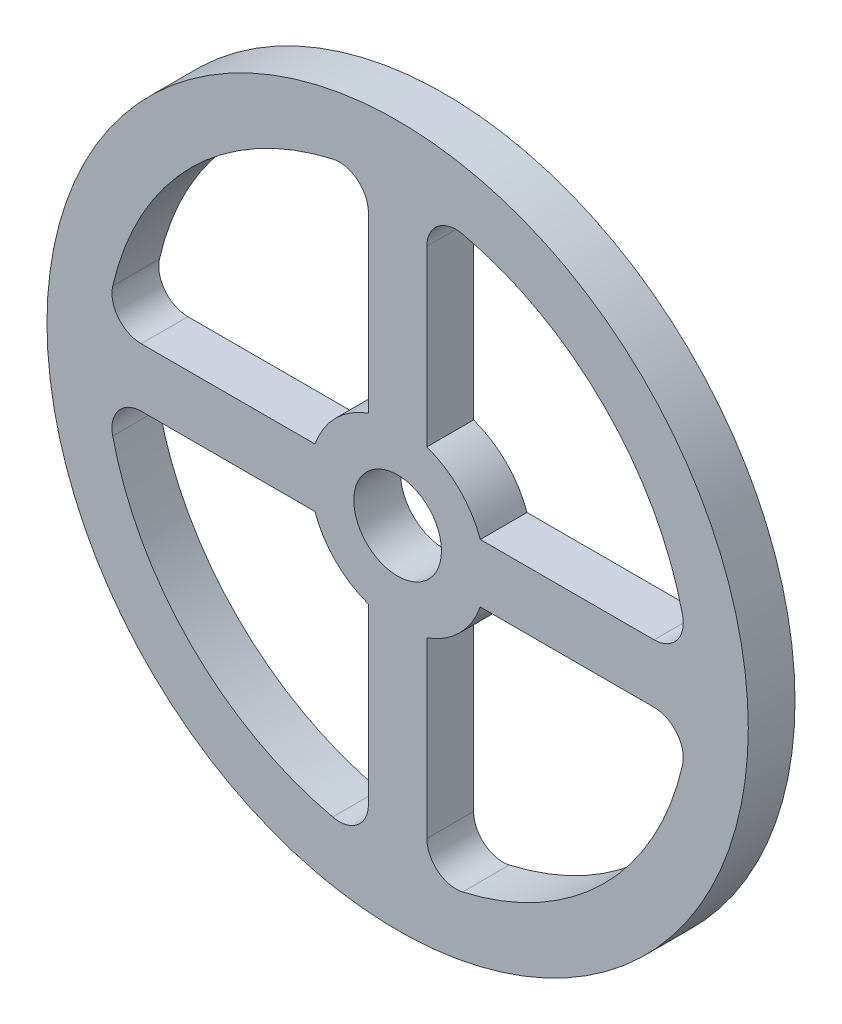
ISO-10303-21;
HEADER;
FILE_DESCRIPTION(('STEP AP214'),'2;1');
FILE_NAME('part.step','',(''),(''),'','','');
FILE_SCHEMA(('AUTOMOTIVE_DESIGN { 1 0 10303 214 1 1 1 1 }'));
ENDSEC;
DATA;
#1=APPLICATION_CONTEXT('core data for automotive mechanical design processes');
#2=APPLICATION_PROTOCOL_DEFINITION('international standard','automotive_design',2000,#1);
#3=PRODUCT_CONTEXT('',#1,'mechanical');
#4=PRODUCT('Part','Part','',(#3));
#5=PRODUCT_RELATED_PRODUCT_CATEGORY('part','',(#4));
#6=PRODUCT_DEFINITION_FORMATION('','',#4);
#7=PRODUCT_DEFINITION_CONTEXT('part definition',#1,'design');
#8=PRODUCT_DEFINITION('design','',#6,#7);
#9=PRODUCT_DEFINITION_SHAPE('','',#8);
#10=(LENGTH_UNIT() NAMED_UNIT(*) SI_UNIT(.MILLI.,.METRE.));
#11=(NAMED_UNIT(*) PLANE_ANGLE_UNIT() SI_UNIT($,.RADIAN.));
#12=(NAMED_UNIT(*) SI_UNIT($,.STERADIAN.) SOLID_ANGLE_UNIT());
#13=UNCERTAINTY_MEASURE_WITH_UNIT(LENGTH_MEASURE(1.E-05),#10,'distance_accuracy_value','');
#14=(GEOMETRIC_REPRESENTATION_CONTEXT(3) GLOBAL_UNCERTAINTY_ASSIGNED_CONTEXT((#13)) GLOBAL_UNIT_ASSIGNED_CONTEXT((#10,
#11,#12)) REPRESENTATION_CONTEXT('',''));
#15=CARTESIAN_POINT('',(0.,0.,0.));
#16=DIRECTION('',(0.,0.,1.));
#17=DIRECTION('',(1.,0.,0.));
#18=AXIS2_PLACEMENT_3D('',#15,#16,#17);
#19=CARTESIAN_POINT('',(-157.313413120744,131.737380840465,16.));
#20=DIRECTION('',(0.,0.,1.));
#21=DIRECTION('',(1.,0.,0.));
#22=AXIS2_PLACEMENT_3D('',#19,#20,#21);
#23=PLANE('',#22);
#24=DIRECTION('',(1.,0.,0.));
#25=VECTOR('',#24,1.);
#26=CARTESIAN_POINT('',(-245.063056994665,141.737380840465,16.));
#27=LINE('',#26,#25);
#28=CARTESIAN_POINT('',(-245.063056994665,141.737380840465,16.));
#29=VERTEX_POINT('',#28);
#30=CARTESIAN_POINT('',(-185.597684368206,141.737380840465,16.));
#31=VERTEX_POINT('',#30);
#32=EDGE_CURVE('E411',#29,#31,#27,.T.);
#33=ORIENTED_EDGE('',*,*,#32,.F.);
#34=CARTESIAN_POINT('',(-245.063056994665,151.737380840465,16.));
#35=DIRECTION('',(0.,0.,1.));
#36=DIRECTION('',(-1.,0.,0.));
#37=AXIS2_PLACEMENT_3D('',#34,#35,#36);
#38=CIRCLE('',#37,10.);
#39=CARTESIAN_POINT('',(-254.813017425101,153.959603062687,16.));
#40=VERTEX_POINT('',#39);
#41=EDGE_CURVE('E408',#40,#29,#38,.T.);
#42=ORIENTED_EDGE('',*,*,#41,.F.);
#43=CARTESIAN_POINT('',(-157.313413120744,131.737380840465,16.));
#44=DIRECTION('',(0.,0.,1.));
#45=DIRECTION('',(1.,0.,0.));
#46=AXIS2_PLACEMENT_3D('',#43,#44,#45);
#47=CIRCLE('',#46,100.);
#48=CARTESIAN_POINT('',(-179.535635342966,229.236985144822,16.));
#49=VERTEX_POINT('',#48);
#50=EDGE_CURVE('E425',#49,#40,#47,.T.);
#51=ORIENTED_EDGE('',*,*,#50,.F.);
#52=CARTESIAN_POINT('',(-177.313413120744,219.487024714386,16.));
#53=DIRECTION('',(0.,0.,1.));
#54=DIRECTION('',(1.,0.,0.));
#55=AXIS2_PLACEMENT_3D('',#52,#53,#54);
#56=CIRCLE('',#55,9.99999999999999);
#57=CARTESIAN_POINT('',(-167.313413120744,219.487024714386,16.));
#58=VERTEX_POINT('',#57);
#59=EDGE_CURVE('E421',#58,#49,#56,.T.);
#60=ORIENTED_EDGE('',*,*,#59,.F.);
#61=DIRECTION('',(0.,1.,0.));
#62=VECTOR('',#61,1.);
#63=CARTESIAN_POINT('',(-167.313413120744,219.487024714386,16.));
#64=LINE('',#63,#62);
#65=CARTESIAN_POINT('',(-167.313413120744,160.021652087927,16.));
#66=VERTEX_POINT('',#65);
#67=EDGE_CURVE('E418',#66,#58,#64,.T.);
#68=ORIENTED_EDGE('',*,*,#67,.F.);
#69=CARTESIAN_POINT('',(-157.313413120744,131.737380840465,16.));
#70=DIRECTION('',(0.,0.,-1.));
#71=DIRECTION('',(1.,0.,0.));
#72=AXIS2_PLACEMENT_3D('',#69,#70,#71);
#73=CIRCLE('',#72,30.);
#74=EDGE_CURVE('E415',#31,#66,#73,.T.);
#75=ORIENTED_EDGE('',*,*,#74,.F.);
#76=EDGE_LOOP('',(#33,#42,#51,#60,#68,#75));
#77=FACE_BOUND('',#76,.T.);
#78=CARTESIAN_POINT('',(-157.313413120744,131.737380840465,16.));
#79=DIRECTION('',(0.,0.,1.));
#80=DIRECTION('',(1.,0.,0.));
#81=AXIS2_PLACEMENT_3D('',#78,#79,#80);
#82=CIRCLE('',#81,120.);
#83=CARTESIAN_POINT('',(-37.3134131207438,131.737380840465,16.));
#84=VERTEX_POINT('',#83);
#85=EDGE_CURVE('E11',#84,#84,#82,.T.);
#86=ORIENTED_EDGE('',*,*,#85,.T.);
#87=EDGE_LOOP('',(#86));
#88=FACE_BOUND('',#87,.T.);
#89=CARTESIAN_POINT('',(-157.313413120744,131.737380840465,16.));
#90=DIRECTION('',(0.,0.,1.));
#91=DIRECTION('',(1.,0.,0.));
#92=AXIS2_PLACEMENT_3D('',#89,#90,#91);
#93=CIRCLE('',#92,15.);
#94=CARTESIAN_POINT('',(-142.313413120744,131.737380840465,16.));
#95=VERTEX_POINT('',#94);
#96=EDGE_CURVE('E400',#95,#95,#93,.T.);
#97=ORIENTED_EDGE('',*,*,#96,.F.);
#98=EDGE_LOOP('',(#97));
#99=FACE_BOUND('',#98,.T.);
#100=DIRECTION('',(-1.,0.,0.));
#101=VECTOR('',#100,1.);
#102=CARTESIAN_POINT('',(-245.063056994665,121.737380840465,16.));
#103=LINE('',#102,#101);
#104=CARTESIAN_POINT('',(-185.597684368206,121.737380840465,16.));
#105=VERTEX_POINT('',#104);
#106=CARTESIAN_POINT('',(-245.063056994665,121.737380840465,16.));
#107=VERTEX_POINT('',#106);
#108=EDGE_CURVE('E340',#105,#107,#103,.T.);
#109=ORIENTED_EDGE('',*,*,#108,.F.);
#110=CARTESIAN_POINT('',(-157.313413120744,131.737380840465,16.));
#111=DIRECTION('',(0.,0.,-1.));
#112=DIRECTION('',(1.,0.,0.));
#113=AXIS2_PLACEMENT_3D('',#110,#111,#112);
#114=CIRCLE('',#113,30.);
#115=CARTESIAN_POINT('',(-167.313413120744,103.453109593003,16.));
#116=VERTEX_POINT('',#115);
#117=EDGE_CURVE('E337',#116,#105,#114,.T.);
#118=ORIENTED_EDGE('',*,*,#117,.F.);
#119=DIRECTION('',(0.,1.,0.));
#120=VECTOR('',#119,1.);
#121=CARTESIAN_POINT('',(-167.313413120744,103.453109593003,16.));
#122=LINE('',#121,#120);
#123=CARTESIAN_POINT('',(-167.313413120744,43.9877369665436,16.));
#124=VERTEX_POINT('',#123);
#125=EDGE_CURVE('E354',#124,#116,#122,.T.);
#126=ORIENTED_EDGE('',*,*,#125,.F.);
#127=CARTESIAN_POINT('',(-177.313413120744,43.9877369665436,16.));
#128=DIRECTION('',(0.,0.,1.));
#129=DIRECTION('',(1.,0.,0.));
#130=AXIS2_PLACEMENT_3D('',#127,#128,#129);
#131=CIRCLE('',#130,10.);
#132=CARTESIAN_POINT('',(-179.535635342966,34.2377765361079,16.));
#133=VERTEX_POINT('',#132);
#134=EDGE_CURVE('E350',#133,#124,#131,.T.);
#135=ORIENTED_EDGE('',*,*,#134,.F.);
#136=CARTESIAN_POINT('',(-157.313413120744,131.737380840465,16.));
#137=DIRECTION('',(0.,0.,1.));
#138=DIRECTION('',(1.,0.,0.));
#139=AXIS2_PLACEMENT_3D('',#136,#137,#138);
#140=CIRCLE('',#139,100.);
#141=CARTESIAN_POINT('',(-254.813017425101,109.515158618243,16.));
#142=VERTEX_POINT('',#141);
#143=EDGE_CURVE('E347',#142,#133,#140,.T.);
#144=ORIENTED_EDGE('',*,*,#143,.F.);
#145=CARTESIAN_POINT('',(-245.063056994665,111.737380840465,16.));
#146=DIRECTION('',(0.,0.,1.));
#147=DIRECTION('',(1.,0.,0.));
#148=AXIS2_PLACEMENT_3D('',#145,#146,#147);
#149=CIRCLE('',#148,10.);
#150=EDGE_CURVE('E344',#107,#142,#149,.T.);
#151=ORIENTED_EDGE('',*,*,#150,.F.);
#152=EDGE_LOOP('',(#109,#118,#126,#135,#144,#151));
#153=FACE_BOUND('',#152,.T.);
#154=DIRECTION('',(0.,-1.,0.));
#155=VECTOR('',#154,1.);
#156=CARTESIAN_POINT('',(-147.313413120744,103.453109593003,16.));
#157=LINE('',#156,#155);
#158=CARTESIAN_POINT('',(-147.313413120744,103.453109593003,16.));
#159=VERTEX_POINT('',#158);
#160=CARTESIAN_POINT('',(-147.313413120744,43.9877369665436,16.));
#161=VERTEX_POINT('',#160);
#162=EDGE_CURVE('E277',#159,#161,#157,.T.);
#163=ORIENTED_EDGE('',*,*,#162,.F.);
#164=CARTESIAN_POINT('',(-157.313413120744,131.737380840465,16.));
#165=DIRECTION('',(0.,0.,-1.));
#166=DIRECTION('',(1.,0.,0.));
#167=AXIS2_PLACEMENT_3D('',#164,#165,#166);
#168=CIRCLE('',#167,30.);
#169=CARTESIAN_POINT('',(-129.029141873282,121.737380840465,16.));
#170=VERTEX_POINT('',#169);
#171=EDGE_CURVE('E274',#170,#159,#168,.T.);
#172=ORIENTED_EDGE('',*,*,#171,.F.);
#173=DIRECTION('',(-1.,0.,0.));
#174=VECTOR('',#173,1.);
#175=CARTESIAN_POINT('',(-129.029141873282,121.737380840465,16.));
#176=LINE('',#175,#174);
#177=CARTESIAN_POINT('',(-69.5637692468226,121.737380840465,16.));
#178=VERTEX_POINT('',#177);
#179=EDGE_CURVE('E291',#178,#170,#176,.T.);
#180=ORIENTED_EDGE('',*,*,#179,.F.);
#181=CARTESIAN_POINT('',(-69.5637692468226,111.737380840465,16.));
#182=DIRECTION('',(0.,0.,1.));
#183=DIRECTION('',(1.,0.,0.));
#184=AXIS2_PLACEMENT_3D('',#181,#182,#183);
#185=CIRCLE('',#184,9.99999999999999);
#186=CARTESIAN_POINT('',(-59.8138088163869,109.515158618243,16.));
#187=VERTEX_POINT('',#186);
#188=EDGE_CURVE('E287',#187,#178,#185,.T.);
#189=ORIENTED_EDGE('',*,*,#188,.F.);
#190=CARTESIAN_POINT('',(-157.313413120744,131.737380840465,16.));
#191=DIRECTION('',(0.,0.,1.));
#192=DIRECTION('',(1.,0.,0.));
#193=AXIS2_PLACEMENT_3D('',#190,#191,#192);
#194=CIRCLE('',#193,100.);
#195=CARTESIAN_POINT('',(-135.091190898522,34.2377765361079,16.));
#196=VERTEX_POINT('',#195);
#197=EDGE_CURVE('E284',#196,#187,#194,.T.);
#198=ORIENTED_EDGE('',*,*,#197,.F.);
#199=CARTESIAN_POINT('',(-137.313413120744,43.9877369665436,16.));
#200=DIRECTION('',(0.,0.,1.));
#201=DIRECTION('',(-1.,0.,0.));
#202=AXIS2_PLACEMENT_3D('',#199,#200,#201);
#203=CIRCLE('',#202,9.99999999999999);
#204=EDGE_CURVE('E281',#161,#196,#203,.T.);
#205=ORIENTED_EDGE('',*,*,#204,.F.);
#206=EDGE_LOOP('',(#163,#172,#180,#189,#198,#205));
#207=FACE_BOUND('',#206,.T.);
#208=DIRECTION('',(1.,0.,0.));
#209=VECTOR('',#208,1.);
#210=CARTESIAN_POINT('',(-129.029141873282,141.737380840465,16.));
#211=LINE('',#210,#209);
#212=CARTESIAN_POINT('',(-129.029141873282,141.737380840465,16.));
#213=VERTEX_POINT('',#212);
#214=CARTESIAN_POINT('',(-69.5637692468226,141.737380840465,16.));
#215=VERTEX_POINT('',#214);
#216=EDGE_CURVE('E214',#213,#215,#211,.T.);
#217=ORIENTED_EDGE('',*,*,#216,.F.);
#218=CARTESIAN_POINT('',(-157.313413120744,131.737380840465,16.));
#219=DIRECTION('',(0.,0.,-1.));
#220=DIRECTION('',(1.,0.,0.));
#221=AXIS2_PLACEMENT_3D('',#218,#219,#220);
#222=CIRCLE('',#221,30.);
#223=CARTESIAN_POINT('',(-147.313413120744,160.021652087927,16.));
#224=VERTEX_POINT('',#223);
#225=EDGE_CURVE('E205',#224,#213,#222,.T.);
#226=ORIENTED_EDGE('',*,*,#225,.F.);
#227=DIRECTION('',(0.,-1.,0.));
#228=VECTOR('',#227,1.);
#229=CARTESIAN_POINT('',(-147.313413120744,219.487024714386,16.));
#230=LINE('',#229,#228);
#231=CARTESIAN_POINT('',(-147.313413120744,219.487024714386,16.));
#232=VERTEX_POINT('',#231);
#233=EDGE_CURVE('E240',#232,#224,#230,.T.);
#234=ORIENTED_EDGE('',*,*,#233,.F.);
#235=CARTESIAN_POINT('',(-137.313413120744,219.487024714386,16.));
#236=DIRECTION('',(0.,0.,1.));
#237=DIRECTION('',(-1.,0.,0.));
#238=AXIS2_PLACEMENT_3D('',#235,#236,#237);
#239=CIRCLE('',#238,10.);
#240=CARTESIAN_POINT('',(-135.091190898522,229.236985144822,16.));
#241=VERTEX_POINT('',#240);
#242=EDGE_CURVE('E237',#241,#232,#239,.T.);
#243=ORIENTED_EDGE('',*,*,#242,.F.);
#244=CARTESIAN_POINT('',(-157.313413120744,131.737380840465,16.));
#245=DIRECTION('',(0.,0.,1.));
#246=DIRECTION('',(1.,0.,0.));
#247=AXIS2_PLACEMENT_3D('',#244,#245,#246);
#248=CIRCLE('',#247,100.);
#249=CARTESIAN_POINT('',(-59.8138088163869,153.959603062687,16.));
#250=VERTEX_POINT('',#249);
#251=EDGE_CURVE('E232',#250,#241,#248,.T.);
#252=ORIENTED_EDGE('',*,*,#251,.F.);
#253=CARTESIAN_POINT('',(-69.5637692468226,151.737380840465,16.));
#254=DIRECTION('',(0.,0.,1.));
#255=DIRECTION('',(-1.,0.,0.));
#256=AXIS2_PLACEMENT_3D('',#253,#254,#255);
#257=CIRCLE('',#256,9.99999999999999);
#258=EDGE_CURVE('E228',#215,#250,#257,.T.);
#259=ORIENTED_EDGE('',*,*,#258,.F.);
#260=EDGE_LOOP('',(#217,#226,#234,#243,#252,#259));
#261=FACE_BOUND('',#260,.T.);
#262=ADVANCED_FACE('F43',(#77,#88,#99,#153,#207,#261),#23,.T.);
#263=CARTESIAN_POINT('',(-157.313413120744,131.737380840465,0.));
#264=DIRECTION('',(0.,0.,1.));
#265=DIRECTION('',(1.,0.,0.));
#266=AXIS2_PLACEMENT_3D('',#263,#264,#265);
#267=PLANE('',#266);
#268=CARTESIAN_POINT('',(-157.313413120744,131.737380840465,0.));
#269=DIRECTION('',(0.,0.,-1.));
#270=DIRECTION('',(1.,0.,0.));
#271=AXIS2_PLACEMENT_3D('',#268,#269,#270);
#272=CIRCLE('',#271,30.);
#273=CARTESIAN_POINT('',(-129.029141873282,121.737380840465,0.));
#274=VERTEX_POINT('',#273);
#275=CARTESIAN_POINT('',(-147.313413120744,103.453109593003,0.));
#276=VERTEX_POINT('',#275);
#277=EDGE_CURVE('E223',#274,#276,#272,.T.);
#278=ORIENTED_EDGE('',*,*,#277,.T.);
#279=DIRECTION('',(0.,-1.,0.));
#280=VECTOR('',#279,1.);
#281=CARTESIAN_POINT('',(-147.313413120744,103.453109593003,0.));
#282=LINE('',#281,#280);
#283=CARTESIAN_POINT('',(-147.313413120744,43.9877369665436,0.));
#284=VERTEX_POINT('',#283);
#285=EDGE_CURVE('E298',#276,#284,#282,.T.);
#286=ORIENTED_EDGE('',*,*,#285,.T.);
#287=CARTESIAN_POINT('',(-137.313413120744,43.9877369665436,0.));
#288=DIRECTION('',(0.,0.,1.));
#289=DIRECTION('',(-1.,0.,0.));
#290=AXIS2_PLACEMENT_3D('',#287,#288,#289);
#291=CIRCLE('',#290,9.99999999999999);
#292=CARTESIAN_POINT('',(-135.091190898522,34.2377765361079,0.));
#293=VERTEX_POINT('',#292);
#294=EDGE_CURVE('E302',#284,#293,#291,.T.);
#295=ORIENTED_EDGE('',*,*,#294,.T.);
#296=CARTESIAN_POINT('',(-157.313413120744,131.737380840465,0.));
#297=DIRECTION('',(0.,0.,1.));
#298=DIRECTION('',(1.,0.,0.));
#299=AXIS2_PLACEMENT_3D('',#296,#297,#298);
#300=CIRCLE('',#299,100.);
#301=CARTESIAN_POINT('',(-59.8138088163869,109.515158618243,0.));
#302=VERTEX_POINT('',#301);
#303=EDGE_CURVE('E306',#293,#302,#300,.T.);
#304=ORIENTED_EDGE('',*,*,#303,.T.);
#305=CARTESIAN_POINT('',(-69.5637692468226,111.737380840465,0.));
#306=DIRECTION('',(0.,0.,1.));
#307=DIRECTION('',(1.,0.,0.));
#308=AXIS2_PLACEMENT_3D('',#305,#306,#307);
#309=CIRCLE('',#308,9.99999999999999);
#310=CARTESIAN_POINT('',(-69.5637692468226,121.737380840465,0.));
#311=VERTEX_POINT('',#310);
#312=EDGE_CURVE('E310',#302,#311,#309,.T.);
#313=ORIENTED_EDGE('',*,*,#312,.T.);
#314=DIRECTION('',(-1.,0.,0.));
#315=VECTOR('',#314,1.);
#316=CARTESIAN_POINT('',(-129.029141873282,121.737380840465,0.));
#317=LINE('',#316,#315);
#318=EDGE_CURVE('E278',#311,#274,#317,.T.);
#319=ORIENTED_EDGE('',*,*,#318,.T.);
#320=EDGE_LOOP('',(#278,#286,#295,#304,#313,#319));
#321=FACE_BOUND('',#320,.T.);
#322=CARTESIAN_POINT('',(-157.313413120744,131.737380840465,0.));
#323=DIRECTION('',(0.,0.,1.));
#324=DIRECTION('',(1.,0.,0.));
#325=AXIS2_PLACEMENT_3D('',#322,#323,#324);
#326=CIRCLE('',#325,15.);
#327=CARTESIAN_POINT('',(-142.313413120744,131.737380840465,0.));
#328=VERTEX_POINT('',#327);
#329=EDGE_CURVE('E399',#328,#328,#326,.T.);
#330=ORIENTED_EDGE('',*,*,#329,.T.);
#331=EDGE_LOOP('',(#330));
#332=FACE_BOUND('',#331,.T.);
#333=CARTESIAN_POINT('',(-245.063056994665,151.737380840465,0.));
#334=DIRECTION('',(0.,0.,1.));
#335=DIRECTION('',(-1.,0.,0.));
#336=AXIS2_PLACEMENT_3D('',#333,#334,#335);
#337=CIRCLE('',#336,10.);
#338=CARTESIAN_POINT('',(-254.813017425101,153.959603062687,0.));
#339=VERTEX_POINT('',#338);
#340=CARTESIAN_POINT('',(-245.063056994665,141.737380840465,0.));
#341=VERTEX_POINT('',#340);
#342=EDGE_CURVE('E404',#339,#341,#337,.T.);
#343=ORIENTED_EDGE('',*,*,#342,.T.);
#344=DIRECTION('',(1.,0.,0.));
#345=VECTOR('',#344,1.);
#346=CARTESIAN_POINT('',(-245.063056994665,141.737380840465,0.));
#347=LINE('',#346,#345);
#348=CARTESIAN_POINT('',(-185.597684368206,141.737380840465,0.));
#349=VERTEX_POINT('',#348);
#350=EDGE_CURVE('E432',#341,#349,#347,.T.);
#351=ORIENTED_EDGE('',*,*,#350,.T.);
#352=CARTESIAN_POINT('',(-157.313413120744,131.737380840465,0.));
#353=DIRECTION('',(0.,0.,-1.));
#354=DIRECTION('',(1.,0.,0.));
#355=AXIS2_PLACEMENT_3D('',#352,#353,#354);
#356=CIRCLE('',#355,30.);
#357=CARTESIAN_POINT('',(-167.313413120744,160.021652087927,0.));
#358=VERTEX_POINT('',#357);
#359=EDGE_CURVE('E436',#349,#358,#356,.T.);
#360=ORIENTED_EDGE('',*,*,#359,.T.);
#361=DIRECTION('',(0.,1.,0.));
#362=VECTOR('',#361,1.);
#363=CARTESIAN_POINT('',(-167.313413120744,219.487024714386,0.));
#364=LINE('',#363,#362);
#365=CARTESIAN_POINT('',(-167.313413120744,219.487024714386,0.));
#366=VERTEX_POINT('',#365);
#367=EDGE_CURVE('E440',#358,#366,#364,.T.);
#368=ORIENTED_EDGE('',*,*,#367,.T.);
#369=CARTESIAN_POINT('',(-177.313413120744,219.487024714386,0.));
#370=DIRECTION('',(0.,0.,1.));
#371=DIRECTION('',(1.,0.,0.));
#372=AXIS2_PLACEMENT_3D('',#369,#370,#371);
#373=CIRCLE('',#372,9.99999999999999);
#374=CARTESIAN_POINT('',(-179.535635342966,229.236985144822,0.));
#375=VERTEX_POINT('',#374);
#376=EDGE_CURVE('E444',#366,#375,#373,.T.);
#377=ORIENTED_EDGE('',*,*,#376,.T.);
#378=CARTESIAN_POINT('',(-157.313413120744,131.737380840465,0.));
#379=DIRECTION('',(0.,0.,1.));
#380=DIRECTION('',(1.,0.,0.));
#381=AXIS2_PLACEMENT_3D('',#378,#379,#380);
#382=CIRCLE('',#381,100.);
#383=EDGE_CURVE('E412',#375,#339,#382,.T.);
#384=ORIENTED_EDGE('',*,*,#383,.T.);
#385=EDGE_LOOP('',(#343,#351,#360,#368,#377,#384));
#386=FACE_BOUND('',#385,.T.);
#387=CARTESIAN_POINT('',(-157.313413120744,131.737380840465,0.));
#388=DIRECTION('',(0.,0.,1.));
#389=DIRECTION('',(1.,0.,0.));
#390=AXIS2_PLACEMENT_3D('',#387,#388,#389);
#391=CIRCLE('',#390,120.);
#392=CARTESIAN_POINT('',(-37.3134131207438,131.737380840465,0.));
#393=VERTEX_POINT('',#392);
#394=EDGE_CURVE('E47',#393,#393,#391,.T.);
#395=ORIENTED_EDGE('',*,*,#394,.F.);
#396=EDGE_LOOP('',(#395));
#397=FACE_BOUND('',#396,.T.);
#398=CARTESIAN_POINT('',(-157.313413120744,131.737380840465,0.));
#399=DIRECTION('',(0.,0.,-1.));
#400=DIRECTION('',(1.,0.,0.));
#401=AXIS2_PLACEMENT_3D('',#398,#399,#400);
#402=CIRCLE('',#401,30.);
#403=CARTESIAN_POINT('',(-167.313413120744,103.453109593003,0.));
#404=VERTEX_POINT('',#403);
#405=CARTESIAN_POINT('',(-185.597684368206,121.737380840465,0.));
#406=VERTEX_POINT('',#405);
#407=EDGE_CURVE('E336',#404,#406,#402,.T.);
#408=ORIENTED_EDGE('',*,*,#407,.T.);
#409=DIRECTION('',(-1.,0.,0.));
#410=VECTOR('',#409,1.);
#411=CARTESIAN_POINT('',(-245.063056994665,121.737380840465,0.));
#412=LINE('',#411,#410);
#413=CARTESIAN_POINT('',(-245.063056994665,121.737380840465,0.));
#414=VERTEX_POINT('',#413);
#415=EDGE_CURVE('E361',#406,#414,#412,.T.);
#416=ORIENTED_EDGE('',*,*,#415,.T.);
#417=CARTESIAN_POINT('',(-245.063056994665,111.737380840465,0.));
#418=DIRECTION('',(0.,0.,1.));
#419=DIRECTION('',(1.,0.,0.));
#420=AXIS2_PLACEMENT_3D('',#417,#418,#419);
#421=CIRCLE('',#420,10.);
#422=CARTESIAN_POINT('',(-254.813017425101,109.515158618243,0.));
#423=VERTEX_POINT('',#422);
#424=EDGE_CURVE('E365',#414,#423,#421,.T.);
#425=ORIENTED_EDGE('',*,*,#424,.T.);
#426=CARTESIAN_POINT('',(-157.313413120744,131.737380840465,0.));
#427=DIRECTION('',(0.,0.,1.));
#428=DIRECTION('',(1.,0.,0.));
#429=AXIS2_PLACEMENT_3D('',#426,#427,#428);
#430=CIRCLE('',#429,100.);
#431=CARTESIAN_POINT('',(-179.535635342966,34.2377765361079,0.));
#432=VERTEX_POINT('',#431);
#433=EDGE_CURVE('E369',#423,#432,#430,.T.);
#434=ORIENTED_EDGE('',*,*,#433,.T.);
#435=CARTESIAN_POINT('',(-177.313413120744,43.9877369665436,0.));
#436=DIRECTION('',(0.,0.,1.));
#437=DIRECTION('',(1.,0.,0.));
#438=AXIS2_PLACEMENT_3D('',#435,#436,#437);
#439=CIRCLE('',#438,10.);
#440=CARTESIAN_POINT('',(-167.313413120744,43.9877369665436,0.));
#441=VERTEX_POINT('',#440);
#442=EDGE_CURVE('E373',#432,#441,#439,.T.);
#443=ORIENTED_EDGE('',*,*,#442,.T.);
#444=DIRECTION('',(0.,1.,0.));
#445=VECTOR('',#444,1.);
#446=CARTESIAN_POINT('',(-167.313413120744,103.453109593003,0.));
#447=LINE('',#446,#445);
#448=EDGE_CURVE('E341',#441,#404,#447,.T.);
#449=ORIENTED_EDGE('',*,*,#448,.T.);
#450=EDGE_LOOP('',(#408,#416,#425,#434,#443,#449));
#451=FACE_BOUND('',#450,.T.);
#452=CARTESIAN_POINT('',(-157.313413120744,131.737380840465,0.));
#453=DIRECTION('',(0.,0.,-1.));
#454=DIRECTION('',(1.,0.,0.));
#455=AXIS2_PLACEMENT_3D('',#452,#453,#454);
#456=CIRCLE('',#455,30.);
#457=CARTESIAN_POINT('',(-147.313413120744,160.021652087927,0.));
#458=VERTEX_POINT('',#457);
#459=CARTESIAN_POINT('',(-129.029141873282,141.737380840465,0.));
#460=VERTEX_POINT('',#459);
#461=EDGE_CURVE('E67',#458,#460,#456,.T.);
#462=ORIENTED_EDGE('',*,*,#461,.T.);
#463=DIRECTION('',(1.,0.,0.));
#464=VECTOR('',#463,1.);
#465=CARTESIAN_POINT('',(-129.029141873282,141.737380840465,0.));
#466=LINE('',#465,#464);
#467=CARTESIAN_POINT('',(-69.5637692468226,141.737380840465,0.));
#468=VERTEX_POINT('',#467);
#469=EDGE_CURVE('E221',#460,#468,#466,.T.);
#470=ORIENTED_EDGE('',*,*,#469,.T.);
#471=CARTESIAN_POINT('',(-69.5637692468226,151.737380840465,0.));
#472=DIRECTION('',(0.,0.,1.));
#473=DIRECTION('',(-1.,0.,0.));
#474=AXIS2_PLACEMENT_3D('',#471,#472,#473);
#475=CIRCLE('',#474,9.99999999999999);
#476=CARTESIAN_POINT('',(-59.8138088163869,153.959603062687,0.));
#477=VERTEX_POINT('',#476);
#478=EDGE_CURVE('E247',#468,#477,#475,.T.);
#479=ORIENTED_EDGE('',*,*,#478,.T.);
#480=CARTESIAN_POINT('',(-157.313413120744,131.737380840465,0.));
#481=DIRECTION('',(0.,0.,1.));
#482=DIRECTION('',(1.,0.,0.));
#483=AXIS2_PLACEMENT_3D('',#480,#481,#482);
#484=CIRCLE('',#483,100.);
#485=CARTESIAN_POINT('',(-135.091190898522,229.236985144822,0.));
#486=VERTEX_POINT('',#485);
#487=EDGE_CURVE('E251',#477,#486,#484,.T.);
#488=ORIENTED_EDGE('',*,*,#487,.T.);
#489=CARTESIAN_POINT('',(-137.313413120744,219.487024714386,0.));
#490=DIRECTION('',(0.,0.,1.));
#491=DIRECTION('',(-1.,0.,0.));
#492=AXIS2_PLACEMENT_3D('',#489,#490,#491);
#493=CIRCLE('',#492,10.);
#494=CARTESIAN_POINT('',(-147.313413120744,219.487024714386,0.));
#495=VERTEX_POINT('',#494);
#496=EDGE_CURVE('E255',#486,#495,#493,.T.);
#497=ORIENTED_EDGE('',*,*,#496,.T.);
#498=DIRECTION('',(0.,-1.,0.));
#499=VECTOR('',#498,1.);
#500=CARTESIAN_POINT('',(-147.313413120744,219.487024714386,0.));
#501=LINE('',#500,#499);
#502=EDGE_CURVE('E215',#495,#458,#501,.T.);
#503=ORIENTED_EDGE('',*,*,#502,.T.);
#504=EDGE_LOOP('',(#462,#470,#479,#488,#497,#503));
#505=FACE_BOUND('',#504,.T.);
#506=ADVANCED_FACE('F476',(#321,#332,#386,#397,#451,#505),#267,.F.);
#507=CARTESIAN_POINT('',(-157.313413120744,131.737380840465,16.));
#508=DIRECTION('',(0.,0.,-1.));
#509=DIRECTION('',(-1.,0.,0.));
#510=AXIS2_PLACEMENT_3D('',#507,#508,#509);
#511=CYLINDRICAL_SURFACE('',#510,120.);
#512=ORIENTED_EDGE('',*,*,#85,.F.);
#513=EDGE_LOOP('',(#512));
#514=FACE_BOUND('',#513,.T.);
#515=ORIENTED_EDGE('',*,*,#394,.T.);
#516=EDGE_LOOP('',(#515));
#517=FACE_BOUND('',#516,.T.);
#518=ADVANCED_FACE('F45',(#514,#517),#511,.T.);
#519=CARTESIAN_POINT('',(-245.063056994665,151.737380840465,16.));
#520=DIRECTION('',(0.,0.,-1.));
#521=DIRECTION('',(-1.,0.,0.));
#522=AXIS2_PLACEMENT_3D('',#519,#520,#521);
#523=CYLINDRICAL_SURFACE('',#522,10.);
#524=ORIENTED_EDGE('',*,*,#342,.F.);
#525=DIRECTION('',(0.,0.,-1.));
#526=VECTOR('',#525,1.);
#527=CARTESIAN_POINT('',(-254.813017425101,153.959603062687,16.));
#528=LINE('',#527,#526);
#529=EDGE_CURVE('E428',#40,#339,#528,.T.);
#530=ORIENTED_EDGE('',*,*,#529,.F.);
#531=ORIENTED_EDGE('',*,*,#41,.T.);
#532=DIRECTION('',(0.,0.,-1.));
#533=VECTOR('',#532,1.);
#534=CARTESIAN_POINT('',(-245.063056994665,141.737380840465,16.));
#535=LINE('',#534,#533);
#536=EDGE_CURVE('E466',#29,#341,#535,.T.);
#537=ORIENTED_EDGE('',*,*,#536,.T.);
#538=EDGE_LOOP('',(#524,#530,#531,#537));
#539=FACE_BOUND('',#538,.T.);
#540=ADVANCED_FACE('F510',(#539),#523,.F.);
#541=CARTESIAN_POINT('',(-245.063056994665,141.737380840465,16.));
#542=DIRECTION('',(0.,1.,0.));
#543=DIRECTION('',(0.,0.,1.));
#544=AXIS2_PLACEMENT_3D('',#541,#542,#543);
#545=PLANE('',#544);
#546=ORIENTED_EDGE('',*,*,#350,.F.);
#547=ORIENTED_EDGE('',*,*,#536,.F.);
#548=ORIENTED_EDGE('',*,*,#32,.T.);
#549=DIRECTION('',(0.,0.,-1.));
#550=VECTOR('',#549,1.);
#551=CARTESIAN_POINT('',(-185.597684368206,141.737380840465,16.));
#552=LINE('',#551,#550);
#553=EDGE_CURVE('E463',#31,#349,#552,.T.);
#554=ORIENTED_EDGE('',*,*,#553,.T.);
#555=EDGE_LOOP('',(#546,#547,#548,#554));
#556=FACE_BOUND('',#555,.T.);
#557=ADVANCED_FACE('F513',(#556),#545,.T.);
#558=CARTESIAN_POINT('',(-157.313413120744,131.737380840465,16.));
#559=DIRECTION('',(0.,0.,-1.));
#560=DIRECTION('',(-1.,0.,0.));
#561=AXIS2_PLACEMENT_3D('',#558,#559,#560);
#562=CYLINDRICAL_SURFACE('',#561,30.);
#563=ORIENTED_EDGE('',*,*,#359,.F.);
#564=ORIENTED_EDGE('',*,*,#553,.F.);
#565=ORIENTED_EDGE('',*,*,#74,.T.);
#566=DIRECTION('',(0.,0.,-1.));
#567=VECTOR('',#566,1.);
#568=CARTESIAN_POINT('',(-167.313413120744,160.021652087927,16.));
#569=LINE('',#568,#567);
#570=EDGE_CURVE('E460',#66,#358,#569,.T.);
#571=ORIENTED_EDGE('',*,*,#570,.T.);
#572=EDGE_LOOP('',(#563,#564,#565,#571));
#573=FACE_BOUND('',#572,.T.);
#574=ADVANCED_FACE('F516',(#573),#562,.T.);
#575=CARTESIAN_POINT('',(-167.313413120744,219.487024714386,16.));
#576=DIRECTION('',(-1.,0.,0.));
#577=DIRECTION('',(0.,0.,1.));
#578=AXIS2_PLACEMENT_3D('',#575,#576,#577);
#579=PLANE('',#578);
#580=ORIENTED_EDGE('',*,*,#367,.F.);
#581=ORIENTED_EDGE('',*,*,#570,.F.);
#582=ORIENTED_EDGE('',*,*,#67,.T.);
#583=DIRECTION('',(0.,0.,-1.));
#584=VECTOR('',#583,1.);
#585=CARTESIAN_POINT('',(-167.313413120744,219.487024714386,16.));
#586=LINE('',#585,#584);
#587=EDGE_CURVE('E457',#58,#366,#586,.T.);
#588=ORIENTED_EDGE('',*,*,#587,.T.);
#589=EDGE_LOOP('',(#580,#581,#582,#588));
#590=FACE_BOUND('',#589,.T.);
#591=ADVANCED_FACE('F520',(#590),#579,.T.);
#592=CARTESIAN_POINT('',(-177.313413120744,219.487024714386,16.));
#593=DIRECTION('',(0.,0.,-1.));
#594=DIRECTION('',(-1.,0.,0.));
#595=AXIS2_PLACEMENT_3D('',#592,#593,#594);
#596=CYLINDRICAL_SURFACE('',#595,9.99999999999999);
#597=ORIENTED_EDGE('',*,*,#376,.F.);
#598=ORIENTED_EDGE('',*,*,#587,.F.);
#599=ORIENTED_EDGE('',*,*,#59,.T.);
#600=DIRECTION('',(0.,0.,-1.));
#601=VECTOR('',#600,1.);
#602=CARTESIAN_POINT('',(-179.535635342966,229.236985144822,16.));
#603=LINE('',#602,#601);
#604=EDGE_CURVE('E454',#49,#375,#603,.T.);
#605=ORIENTED_EDGE('',*,*,#604,.T.);
#606=EDGE_LOOP('',(#597,#598,#599,#605));
#607=FACE_BOUND('',#606,.T.);
#608=ADVANCED_FACE('F524',(#607),#596,.F.);
#609=CARTESIAN_POINT('',(-157.313413120744,131.737380840465,16.));
#610=DIRECTION('',(0.,0.,-1.));
#611=DIRECTION('',(-1.,0.,0.));
#612=AXIS2_PLACEMENT_3D('',#609,#610,#611);
#613=CYLINDRICAL_SURFACE('',#612,100.);
#614=ORIENTED_EDGE('',*,*,#383,.F.);
#615=ORIENTED_EDGE('',*,*,#604,.F.);
#616=ORIENTED_EDGE('',*,*,#50,.T.);
#617=ORIENTED_EDGE('',*,*,#529,.T.);
#618=EDGE_LOOP('',(#614,#615,#616,#617));
#619=FACE_BOUND('',#618,.T.);
#620=ADVANCED_FACE('F528',(#619),#613,.F.);
#621=CARTESIAN_POINT('',(-157.313413120744,131.737380840465,16.));
#622=DIRECTION('',(0.,0.,-1.));
#623=DIRECTION('',(-1.,0.,0.));
#624=AXIS2_PLACEMENT_3D('',#621,#622,#623);
#625=CYLINDRICAL_SURFACE('',#624,15.);
#626=ORIENTED_EDGE('',*,*,#96,.T.);
#627=EDGE_LOOP('',(#626));
#628=FACE_BOUND('',#627,.T.);
#629=ORIENTED_EDGE('',*,*,#329,.F.);
#630=EDGE_LOOP('',(#629));
#631=FACE_BOUND('',#630,.T.);
#632=ADVANCED_FACE('F532',(#628,#631),#625,.F.);
#633=CARTESIAN_POINT('',(-157.313413120744,131.737380840465,16.));
#634=DIRECTION('',(0.,0.,-1.));
#635=DIRECTION('',(-1.,0.,0.));
#636=AXIS2_PLACEMENT_3D('',#633,#634,#635);
#637=CYLINDRICAL_SURFACE('',#636,30.);
#638=ORIENTED_EDGE('',*,*,#407,.F.);
#639=DIRECTION('',(0.,0.,-1.));
#640=VECTOR('',#639,1.);
#641=CARTESIAN_POINT('',(-167.313413120744,103.453109593003,16.));
#642=LINE('',#641,#640);
#643=EDGE_CURVE('E357',#116,#404,#642,.T.);
#644=ORIENTED_EDGE('',*,*,#643,.F.);
#645=ORIENTED_EDGE('',*,*,#117,.T.);
#646=DIRECTION('',(0.,0.,-1.));
#647=VECTOR('',#646,1.);
#648=CARTESIAN_POINT('',(-185.597684368206,121.737380840465,16.));
#649=LINE('',#648,#647);
#650=EDGE_CURVE('E395',#105,#406,#649,.T.);
#651=ORIENTED_EDGE('',*,*,#650,.T.);
#652=EDGE_LOOP('',(#638,#644,#645,#651));
#653=FACE_BOUND('',#652,.T.);
#654=ADVANCED_FACE('F536',(#653),#637,.T.);
#655=CARTESIAN_POINT('',(-245.063056994665,121.737380840465,16.));
#656=DIRECTION('',(0.,-1.,0.));
#657=DIRECTION('',(0.,0.,-1.));
#658=AXIS2_PLACEMENT_3D('',#655,#656,#657);
#659=PLANE('',#658);
#660=ORIENTED_EDGE('',*,*,#415,.F.);
#661=ORIENTED_EDGE('',*,*,#650,.F.);
#662=ORIENTED_EDGE('',*,*,#108,.T.);
#663=DIRECTION('',(0.,0.,-1.));
#664=VECTOR('',#663,1.);
#665=CARTESIAN_POINT('',(-245.063056994665,121.737380840465,16.));
#666=LINE('',#665,#664);
#667=EDGE_CURVE('E392',#107,#414,#666,.T.);
#668=ORIENTED_EDGE('',*,*,#667,.T.);
#669=EDGE_LOOP('',(#660,#661,#662,#668));
#670=FACE_BOUND('',#669,.T.);
#671=ADVANCED_FACE('F540',(#670),#659,.T.);
#672=CARTESIAN_POINT('',(-245.063056994665,111.737380840465,16.));
#673=DIRECTION('',(0.,0.,-1.));
#674=DIRECTION('',(-1.,0.,0.));
#675=AXIS2_PLACEMENT_3D('',#672,#673,#674);
#676=CYLINDRICAL_SURFACE('',#675,10.);
#677=ORIENTED_EDGE('',*,*,#424,.F.);
#678=ORIENTED_EDGE('',*,*,#667,.F.);
#679=ORIENTED_EDGE('',*,*,#150,.T.);
#680=DIRECTION('',(0.,0.,-1.));
#681=VECTOR('',#680,1.);
#682=CARTESIAN_POINT('',(-254.813017425101,109.515158618243,16.));
#683=LINE('',#682,#681);
#684=EDGE_CURVE('E389',#142,#423,#683,.T.);
#685=ORIENTED_EDGE('',*,*,#684,.T.);
#686=EDGE_LOOP('',(#677,#678,#679,#685));
#687=FACE_BOUND('',#686,.T.);
#688=ADVANCED_FACE('F544',(#687),#676,.F.);
#689=CARTESIAN_POINT('',(-157.313413120744,131.737380840465,16.));
#690=DIRECTION('',(0.,0.,-1.));
#691=DIRECTION('',(-1.,0.,0.));
#692=AXIS2_PLACEMENT_3D('',#689,#690,#691);
#693=CYLINDRICAL_SURFACE('',#692,100.);
#694=ORIENTED_EDGE('',*,*,#433,.F.);
#695=ORIENTED_EDGE('',*,*,#684,.F.);
#696=ORIENTED_EDGE('',*,*,#143,.T.);
#697=DIRECTION('',(0.,0.,-1.));
#698=VECTOR('',#697,1.);
#699=CARTESIAN_POINT('',(-179.535635342966,34.2377765361079,16.));
#700=LINE('',#699,#698);
#701=EDGE_CURVE('E386',#133,#432,#700,.T.);
#702=ORIENTED_EDGE('',*,*,#701,.T.);
#703=EDGE_LOOP('',(#694,#695,#696,#702));
#704=FACE_BOUND('',#703,.T.);
#705=ADVANCED_FACE('F548',(#704),#693,.F.);
#706=CARTESIAN_POINT('',(-177.313413120744,43.9877369665436,16.));
#707=DIRECTION('',(0.,0.,-1.));
#708=DIRECTION('',(-1.,0.,0.));
#709=AXIS2_PLACEMENT_3D('',#706,#707,#708);
#710=CYLINDRICAL_SURFACE('',#709,10.);
#711=ORIENTED_EDGE('',*,*,#442,.F.);
#712=ORIENTED_EDGE('',*,*,#701,.F.);
#713=ORIENTED_EDGE('',*,*,#134,.T.);
#714=DIRECTION('',(0.,0.,-1.));
#715=VECTOR('',#714,1.);
#716=CARTESIAN_POINT('',(-167.313413120744,43.9877369665436,16.));
#717=LINE('',#716,#715);
#718=EDGE_CURVE('E383',#124,#441,#717,.T.);
#719=ORIENTED_EDGE('',*,*,#718,.T.);
#720=EDGE_LOOP('',(#711,#712,#713,#719));
#721=FACE_BOUND('',#720,.T.);
#722=ADVANCED_FACE('F552',(#721),#710,.F.);
#723=CARTESIAN_POINT('',(-167.313413120744,103.453109593003,16.));
#724=DIRECTION('',(-1.,0.,0.));
#725=DIRECTION('',(0.,0.,1.));
#726=AXIS2_PLACEMENT_3D('',#723,#724,#725);
#727=PLANE('',#726);
#728=ORIENTED_EDGE('',*,*,#448,.F.);
#729=ORIENTED_EDGE('',*,*,#718,.F.);
#730=ORIENTED_EDGE('',*,*,#125,.T.);
#731=ORIENTED_EDGE('',*,*,#643,.T.);
#732=EDGE_LOOP('',(#728,#729,#730,#731));
#733=FACE_BOUND('',#732,.T.);
#734=ADVANCED_FACE('F556',(#733),#727,.T.);
#735=CARTESIAN_POINT('',(-157.313413120744,131.737380840465,16.));
#736=DIRECTION('',(0.,0.,-1.));
#737=DIRECTION('',(-1.,0.,0.));
#738=AXIS2_PLACEMENT_3D('',#735,#736,#737);
#739=CYLINDRICAL_SURFACE('',#738,30.);
#740=ORIENTED_EDGE('',*,*,#277,.F.);
#741=DIRECTION('',(0.,0.,-1.));
#742=VECTOR('',#741,1.);
#743=CARTESIAN_POINT('',(-129.029141873282,121.737380840465,16.));
#744=LINE('',#743,#742);
#745=EDGE_CURVE('E294',#170,#274,#744,.T.);
#746=ORIENTED_EDGE('',*,*,#745,.F.);
#747=ORIENTED_EDGE('',*,*,#171,.T.);
#748=DIRECTION('',(0.,0.,-1.));
#749=VECTOR('',#748,1.);
#750=CARTESIAN_POINT('',(-147.313413120744,103.453109593003,16.));
#751=LINE('',#750,#749);
#752=EDGE_CURVE('E332',#159,#276,#751,.T.);
#753=ORIENTED_EDGE('',*,*,#752,.T.);
#754=EDGE_LOOP('',(#740,#746,#747,#753));
#755=FACE_BOUND('',#754,.T.);
#756=ADVANCED_FACE('F560',(#755),#739,.T.);
#757=CARTESIAN_POINT('',(-147.313413120744,103.453109593003,16.));
#758=DIRECTION('',(1.,0.,0.));
#759=DIRECTION('',(0.,1.,0.));
#760=AXIS2_PLACEMENT_3D('',#757,#758,#759);
#761=PLANE('',#760);
#762=ORIENTED_EDGE('',*,*,#285,.F.);
#763=ORIENTED_EDGE('',*,*,#752,.F.);
#764=ORIENTED_EDGE('',*,*,#162,.T.);
#765=DIRECTION('',(0.,0.,-1.));
#766=VECTOR('',#765,1.);
#767=CARTESIAN_POINT('',(-147.313413120744,43.9877369665436,16.));
#768=LINE('',#767,#766);
#769=EDGE_CURVE('E329',#161,#284,#768,.T.);
#770=ORIENTED_EDGE('',*,*,#769,.T.);
#771=EDGE_LOOP('',(#762,#763,#764,#770));
#772=FACE_BOUND('',#771,.T.);
#773=ADVANCED_FACE('F564',(#772),#761,.T.);
#774=CARTESIAN_POINT('',(-137.313413120744,43.9877369665436,16.));
#775=DIRECTION('',(0.,0.,-1.));
#776=DIRECTION('',(-1.,0.,0.));
#777=AXIS2_PLACEMENT_3D('',#774,#775,#776);
#778=CYLINDRICAL_SURFACE('',#777,9.99999999999999);
#779=ORIENTED_EDGE('',*,*,#294,.F.);
#780=ORIENTED_EDGE('',*,*,#769,.F.);
#781=ORIENTED_EDGE('',*,*,#204,.T.);
#782=DIRECTION('',(0.,0.,-1.));
#783=VECTOR('',#782,1.);
#784=CARTESIAN_POINT('',(-135.091190898522,34.2377765361079,16.));
#785=LINE('',#784,#783);
#786=EDGE_CURVE('E326',#196,#293,#785,.T.);
#787=ORIENTED_EDGE('',*,*,#786,.T.);
#788=EDGE_LOOP('',(#779,#780,#781,#787));
#789=FACE_BOUND('',#788,.T.);
#790=ADVANCED_FACE('F568',(#789),#778,.F.);
#791=CARTESIAN_POINT('',(-157.313413120744,131.737380840465,16.));
#792=DIRECTION('',(0.,0.,-1.));
#793=DIRECTION('',(-1.,0.,0.));
#794=AXIS2_PLACEMENT_3D('',#791,#792,#793);
#795=CYLINDRICAL_SURFACE('',#794,100.);
#796=ORIENTED_EDGE('',*,*,#303,.F.);
#797=ORIENTED_EDGE('',*,*,#786,.F.);
#798=ORIENTED_EDGE('',*,*,#197,.T.);
#799=DIRECTION('',(0.,0.,-1.));
#800=VECTOR('',#799,1.);
#801=CARTESIAN_POINT('',(-59.8138088163869,109.515158618243,16.));
#802=LINE('',#801,#800);
#803=EDGE_CURVE('E323',#187,#302,#802,.T.);
#804=ORIENTED_EDGE('',*,*,#803,.T.);
#805=EDGE_LOOP('',(#796,#797,#798,#804));
#806=FACE_BOUND('',#805,.T.);
#807=ADVANCED_FACE('F572',(#806),#795,.F.);
#808=CARTESIAN_POINT('',(-69.5637692468226,111.737380840465,16.));
#809=DIRECTION('',(0.,0.,-1.));
#810=DIRECTION('',(-1.,0.,0.));
#811=AXIS2_PLACEMENT_3D('',#808,#809,#810);
#812=CYLINDRICAL_SURFACE('',#811,9.99999999999999);
#813=ORIENTED_EDGE('',*,*,#312,.F.);
#814=ORIENTED_EDGE('',*,*,#803,.F.);
#815=ORIENTED_EDGE('',*,*,#188,.T.);
#816=DIRECTION('',(0.,0.,-1.));
#817=VECTOR('',#816,1.);
#818=CARTESIAN_POINT('',(-69.5637692468226,121.737380840465,16.));
#819=LINE('',#818,#817);
#820=EDGE_CURVE('E320',#178,#311,#819,.T.);
#821=ORIENTED_EDGE('',*,*,#820,.T.);
#822=EDGE_LOOP('',(#813,#814,#815,#821));
#823=FACE_BOUND('',#822,.T.);
#824=ADVANCED_FACE('F576',(#823),#812,.F.);
#825=CARTESIAN_POINT('',(-129.029141873282,121.737380840465,16.));
#826=DIRECTION('',(0.,-1.,0.));
#827=DIRECTION('',(0.,0.,-1.));
#828=AXIS2_PLACEMENT_3D('',#825,#826,#827);
#829=PLANE('',#828);
#830=ORIENTED_EDGE('',*,*,#318,.F.);
#831=ORIENTED_EDGE('',*,*,#820,.F.);
#832=ORIENTED_EDGE('',*,*,#179,.T.);
#833=ORIENTED_EDGE('',*,*,#745,.T.);
#834=EDGE_LOOP('',(#830,#831,#832,#833));
#835=FACE_BOUND('',#834,.T.);
#836=ADVANCED_FACE('F580',(#835),#829,.T.);
#837=CARTESIAN_POINT('',(-157.313413120744,131.737380840465,16.));
#838=DIRECTION('',(0.,0.,-1.));
#839=DIRECTION('',(-1.,0.,0.));
#840=AXIS2_PLACEMENT_3D('',#837,#838,#839);
#841=CYLINDRICAL_SURFACE('',#840,30.);
#842=ORIENTED_EDGE('',*,*,#461,.F.);
#843=DIRECTION('',(0.,0.,-1.));
#844=VECTOR('',#843,1.);
#845=CARTESIAN_POINT('',(-147.313413120744,160.021652087927,16.));
#846=LINE('',#845,#844);
#847=EDGE_CURVE('E209',#224,#458,#846,.T.);
#848=ORIENTED_EDGE('',*,*,#847,.F.);
#849=ORIENTED_EDGE('',*,*,#225,.T.);
#850=DIRECTION('',(0.,0.,-1.));
#851=VECTOR('',#850,1.);
#852=CARTESIAN_POINT('',(-129.029141873282,141.737380840465,16.));
#853=LINE('',#852,#851);
#854=EDGE_CURVE('E208',#213,#460,#853,.T.);
#855=ORIENTED_EDGE('',*,*,#854,.T.);
#856=EDGE_LOOP('',(#842,#848,#849,#855));
#857=FACE_BOUND('',#856,.T.);
#858=ADVANCED_FACE('F207',(#857),#841,.T.);
#859=CARTESIAN_POINT('',(-129.029141873282,141.737380840465,16.));
#860=DIRECTION('',(0.,1.,0.));
#861=DIRECTION('',(0.,0.,1.));
#862=AXIS2_PLACEMENT_3D('',#859,#860,#861);
#863=PLANE('',#862);
#864=ORIENTED_EDGE('',*,*,#469,.F.);
#865=ORIENTED_EDGE('',*,*,#854,.F.);
#866=ORIENTED_EDGE('',*,*,#216,.T.);
#867=DIRECTION('',(0.,0.,-1.));
#868=VECTOR('',#867,1.);
#869=CARTESIAN_POINT('',(-69.5637692468226,141.737380840465,16.));
#870=LINE('',#869,#868);
#871=EDGE_CURVE('E224',#215,#468,#870,.T.);
#872=ORIENTED_EDGE('',*,*,#871,.T.);
#873=EDGE_LOOP('',(#864,#865,#866,#872));
#874=FACE_BOUND('',#873,.T.);
#875=ADVANCED_FACE('F218',(#874),#863,.T.);
#876=CARTESIAN_POINT('',(-69.5637692468226,151.737380840465,16.));
#877=DIRECTION('',(0.,0.,-1.));
#878=DIRECTION('',(-1.,0.,0.));
#879=AXIS2_PLACEMENT_3D('',#876,#877,#878);
#880=CYLINDRICAL_SURFACE('',#879,9.99999999999999);
#881=ORIENTED_EDGE('',*,*,#478,.F.);
#882=ORIENTED_EDGE('',*,*,#871,.F.);
#883=ORIENTED_EDGE('',*,*,#258,.T.);
#884=DIRECTION('',(0.,0.,-1.));
#885=VECTOR('',#884,1.);
#886=CARTESIAN_POINT('',(-59.8138088163869,153.959603062687,16.));
#887=LINE('',#886,#885);
#888=EDGE_CURVE('E269',#250,#477,#887,.T.);
#889=ORIENTED_EDGE('',*,*,#888,.T.);
#890=EDGE_LOOP('',(#881,#882,#883,#889));
#891=FACE_BOUND('',#890,.T.);
#892=ADVANCED_FACE('F493',(#891),#880,.F.);
#893=CARTESIAN_POINT('',(-157.313413120744,131.737380840465,16.));
#894=DIRECTION('',(0.,0.,-1.));
#895=DIRECTION('',(-1.,0.,0.));
#896=AXIS2_PLACEMENT_3D('',#893,#894,#895);
#897=CYLINDRICAL_SURFACE('',#896,100.);
#898=ORIENTED_EDGE('',*,*,#487,.F.);
#899=ORIENTED_EDGE('',*,*,#888,.F.);
#900=ORIENTED_EDGE('',*,*,#251,.T.);
#901=DIRECTION('',(0.,0.,-1.));
#902=VECTOR('',#901,1.);
#903=CARTESIAN_POINT('',(-135.091190898522,229.236985144822,16.));
#904=LINE('',#903,#902);
#905=EDGE_CURVE('E266',#241,#486,#904,.T.);
#906=ORIENTED_EDGE('',*,*,#905,.T.);
#907=EDGE_LOOP('',(#898,#899,#900,#906));
#908=FACE_BOUND('',#907,.T.);
#909=ADVANCED_FACE('F489',(#908),#897,.F.);
#910=CARTESIAN_POINT('',(-137.313413120744,219.487024714386,16.));
#911=DIRECTION('',(0.,0.,-1.));
#912=DIRECTION('',(-1.,0.,0.));
#913=AXIS2_PLACEMENT_3D('',#910,#911,#912);
#914=CYLINDRICAL_SURFACE('',#913,10.);
#915=ORIENTED_EDGE('',*,*,#496,.F.);
#916=ORIENTED_EDGE('',*,*,#905,.F.);
#917=ORIENTED_EDGE('',*,*,#242,.T.);
#918=DIRECTION('',(0.,0.,-1.));
#919=VECTOR('',#918,1.);
#920=CARTESIAN_POINT('',(-147.313413120744,219.487024714386,16.));
#921=LINE('',#920,#919);
#922=EDGE_CURVE('E59',#232,#495,#921,.T.);
#923=ORIENTED_EDGE('',*,*,#922,.T.);
#924=EDGE_LOOP('',(#915,#916,#917,#923));
#925=FACE_BOUND('',#924,.T.);
#926=ADVANCED_FACE('F486',(#925),#914,.F.);
#927=CARTESIAN_POINT('',(-147.313413120744,219.487024714386,16.));
#928=DIRECTION('',(1.,0.,0.));
#929=DIRECTION('',(0.,1.,0.));
#930=AXIS2_PLACEMENT_3D('',#927,#928,#929);
#931=PLANE('',#930);
#932=ORIENTED_EDGE('',*,*,#502,.F.);
#933=ORIENTED_EDGE('',*,*,#922,.F.);
#934=ORIENTED_EDGE('',*,*,#233,.T.);
#935=ORIENTED_EDGE('',*,*,#847,.T.);
#936=EDGE_LOOP('',(#932,#933,#934,#935));
#937=FACE_BOUND('',#936,.T.);
#938=ADVANCED_FACE('F482',(#937),#931,.T.);
#939=CLOSED_SHELL('',(#262,#506,#518,#540,#557,#574,#591,#608,#620,#632,#654,#671,#688,#705,
#722,#734,#756,#773,#790,#807,#824,#836,#858,#875,#892,#909,#926,#938));
#940=MANIFOLD_SOLID_BREP('B2',#939);
#941=ADVANCED_BREP_SHAPE_REPRESENTATION('',(#18,#940),#14);
#942=SHAPE_DEFINITION_REPRESENTATION(#9,#941);
ENDSEC;
END-ISO-10303-21;
